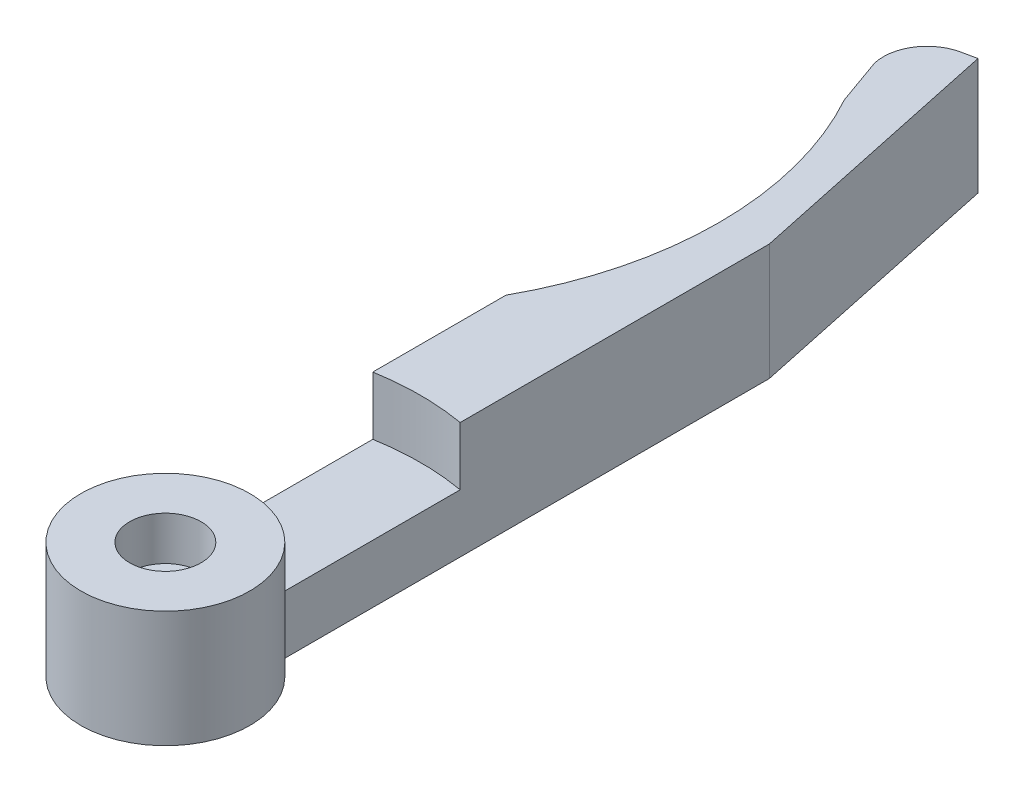
ISO-10303-21;
HEADER;
FILE_DESCRIPTION(('STEP AP214'),'2;1');
FILE_NAME('part.step','',(''),(''),'','','');
FILE_SCHEMA(('AUTOMOTIVE_DESIGN { 1 0 10303 214 1 1 1 1 }'));
ENDSEC;
DATA;
#1=APPLICATION_CONTEXT('core data for automotive mechanical design processes');
#2=APPLICATION_PROTOCOL_DEFINITION('international standard','automotive_design',2000,#1);
#3=PRODUCT_CONTEXT('',#1,'mechanical');
#4=PRODUCT('Part','Part','',(#3));
#5=PRODUCT_RELATED_PRODUCT_CATEGORY('part','',(#4));
#6=PRODUCT_DEFINITION_FORMATION('','',#4);
#7=PRODUCT_DEFINITION_CONTEXT('part definition',#1,'design');
#8=PRODUCT_DEFINITION('design','',#6,#7);
#9=PRODUCT_DEFINITION_SHAPE('','',#8);
#10=(LENGTH_UNIT() NAMED_UNIT(*) SI_UNIT(.MILLI.,.METRE.));
#11=(NAMED_UNIT(*) PLANE_ANGLE_UNIT() SI_UNIT($,.RADIAN.));
#12=(NAMED_UNIT(*) SI_UNIT($,.STERADIAN.) SOLID_ANGLE_UNIT());
#13=UNCERTAINTY_MEASURE_WITH_UNIT(LENGTH_MEASURE(1.E-05),#10,'distance_accuracy_value','');
#14=(GEOMETRIC_REPRESENTATION_CONTEXT(3) GLOBAL_UNCERTAINTY_ASSIGNED_CONTEXT((#13)) GLOBAL_UNIT_ASSIGNED_CONTEXT((#10,
#11,#12)) REPRESENTATION_CONTEXT('',''));
#15=CARTESIAN_POINT('',(0.,0.,0.));
#16=DIRECTION('',(0.,0.,1.));
#17=DIRECTION('',(1.,0.,0.));
#18=AXIS2_PLACEMENT_3D('',#15,#16,#17);
#19=CARTESIAN_POINT('',(0.,8.,0.));
#20=DIRECTION('',(0.,1.,0.));
#21=DIRECTION('',(0.,0.,1.));
#22=AXIS2_PLACEMENT_3D('',#19,#20,#21);
#23=PLANE('',#22);
#24=CARTESIAN_POINT('',(0.,8.,0.));
#25=DIRECTION('',(0.,1.,0.));
#26=DIRECTION('',(0.,0.,1.));
#27=AXIS2_PLACEMENT_3D('',#24,#25,#26);
#28=CIRCLE('',#27,5.8);
#29=CARTESIAN_POINT('',(0.,8.,5.8));
#30=VERTEX_POINT('',#29);
#31=EDGE_CURVE('E163',#30,#30,#28,.T.);
#32=ORIENTED_EDGE('',*,*,#31,.T.);
#33=EDGE_LOOP('',(#32));
#34=FACE_BOUND('',#33,.T.);
#35=CARTESIAN_POINT('',(0.,8.,0.));
#36=DIRECTION('',(0.,1.,0.));
#37=DIRECTION('',(0.,0.,1.));
#38=AXIS2_PLACEMENT_3D('',#35,#36,#37);
#39=CIRCLE('',#38,2.45000000000001);
#40=CARTESIAN_POINT('',(0.,8.,2.45000000000003));
#41=VERTEX_POINT('',#40);
#42=EDGE_CURVE('E193',#41,#41,#39,.T.);
#43=ORIENTED_EDGE('',*,*,#42,.F.);
#44=EDGE_LOOP('',(#43));
#45=FACE_BOUND('',#44,.T.);
#46=ADVANCED_FACE('F41',(#34,#45),#23,.T.);
#47=CARTESIAN_POINT('',(0.,-0.00100000000000013,0.));
#48=DIRECTION('',(0.,1.,0.));
#49=DIRECTION('',(0.,0.,1.));
#50=AXIS2_PLACEMENT_3D('',#47,#48,#49);
#51=CYLINDRICAL_SURFACE('',#50,1.25);
#52=CARTESIAN_POINT('',(0.,5.,0.));
#53=DIRECTION('',(0.,1.,0.));
#54=DIRECTION('',(0.,0.,1.));
#55=AXIS2_PLACEMENT_3D('',#52,#53,#54);
#56=CIRCLE('',#55,1.25);
#57=CARTESIAN_POINT('',(0.,5.,1.25000000000002));
#58=VERTEX_POINT('',#57);
#59=EDGE_CURVE('E196',#58,#58,#56,.T.);
#60=ORIENTED_EDGE('',*,*,#59,.T.);
#61=EDGE_LOOP('',(#60));
#62=FACE_BOUND('',#61,.T.);
#63=CARTESIAN_POINT('',(0.,2.,0.));
#64=DIRECTION('',(0.,-1.,0.));
#65=DIRECTION('',(0.,0.,-1.));
#66=AXIS2_PLACEMENT_3D('',#63,#64,#65);
#67=CIRCLE('',#66,1.25);
#68=CARTESIAN_POINT('',(0.,2.,-1.24999999999998));
#69=VERTEX_POINT('',#68);
#70=EDGE_CURVE('E45',#69,#69,#67,.F.);
#71=ORIENTED_EDGE('',*,*,#70,.F.);
#72=EDGE_LOOP('',(#71));
#73=FACE_BOUND('',#72,.T.);
#74=ADVANCED_FACE('F251',(#62,#73),#51,.F.);
#75=CARTESIAN_POINT('',(0.,8.,0.));
#76=DIRECTION('',(0.,-1.,0.));
#77=DIRECTION('',(0.,0.,-1.));
#78=AXIS2_PLACEMENT_3D('',#75,#76,#77);
#79=CYLINDRICAL_SURFACE('',#78,5.8);
#80=DIRECTION('',(0.,-1.,0.));
#81=VECTOR('',#80,1.);
#82=CARTESIAN_POINT('',(2.99999999999999,8.,-4.96386945839635));
#83=LINE('',#82,#81);
#84=CARTESIAN_POINT('',(2.99999999999999,4.,-4.96386945839635));
#85=VERTEX_POINT('',#84);
#86=CARTESIAN_POINT('',(2.99999999999999,0.,-4.96386945839635));
#87=VERTEX_POINT('',#86);
#88=EDGE_CURVE('E11',#85,#87,#83,.T.);
#89=ORIENTED_EDGE('',*,*,#88,.F.);
#90=CARTESIAN_POINT('',(0.,4.,0.));
#91=DIRECTION('',(0.,-1.,0.));
#92=DIRECTION('',(0.,0.,-1.));
#93=AXIS2_PLACEMENT_3D('',#90,#91,#92);
#94=CIRCLE('',#93,5.80000000000002);
#95=CARTESIAN_POINT('',(-2.99999999999999,4.,-4.96386945839635));
#96=VERTEX_POINT('',#95);
#97=EDGE_CURVE('E214',#96,#85,#94,.T.);
#98=ORIENTED_EDGE('',*,*,#97,.F.);
#99=DIRECTION('',(0.,-1.,0.));
#100=VECTOR('',#99,1.);
#101=CARTESIAN_POINT('',(-2.99999999999999,8.,-4.96386945839635));
#102=LINE('',#101,#100);
#103=CARTESIAN_POINT('',(-2.99999999999999,0.,-4.96386945839635));
#104=VERTEX_POINT('',#103);
#105=EDGE_CURVE('E99',#96,#104,#102,.T.);
#106=ORIENTED_EDGE('',*,*,#105,.T.);
#107=CARTESIAN_POINT('',(0.,0.,0.));
#108=DIRECTION('',(0.,1.,0.));
#109=DIRECTION('',(0.,0.,1.));
#110=AXIS2_PLACEMENT_3D('',#107,#108,#109);
#111=CIRCLE('',#110,5.8);
#112=EDGE_CURVE('E147',#104,#87,#111,.T.);
#113=ORIENTED_EDGE('',*,*,#112,.T.);
#114=EDGE_LOOP('',(#89,#98,#106,#113));
#115=FACE_BOUND('',#114,.T.);
#116=ORIENTED_EDGE('',*,*,#31,.F.);
#117=EDGE_LOOP('',(#116));
#118=FACE_BOUND('',#117,.T.);
#119=ADVANCED_FACE('F43',(#115,#118),#79,.T.);
#120=CARTESIAN_POINT('',(3.,8.,-38.4638694583963));
#121=DIRECTION('',(-1.,0.,0.));
#122=DIRECTION('',(0.,0.,1.));
#123=AXIS2_PLACEMENT_3D('',#120,#121,#122);
#124=PLANE('',#123);
#125=DIRECTION('',(0.,0.,-1.));
#126=VECTOR('',#125,1.);
#127=CARTESIAN_POINT('',(3.,8.,-38.4638694583963));
#128=LINE('',#127,#126);
#129=CARTESIAN_POINT('',(3.,8.,-17.2409396495667));
#130=VERTEX_POINT('',#129);
#131=CARTESIAN_POINT('',(3.,8.,-38.4638694583963));
#132=VERTEX_POINT('',#131);
#133=EDGE_CURVE('E106',#130,#132,#128,.T.);
#134=ORIENTED_EDGE('',*,*,#133,.F.);
#135=DIRECTION('',(0.,1.,0.));
#136=VECTOR('',#135,1.);
#137=CARTESIAN_POINT('',(2.99999999999999,4.,-17.2409396495667));
#138=LINE('',#137,#136);
#139=CARTESIAN_POINT('',(2.99999999999999,4.,-17.2409396495667));
#140=VERTEX_POINT('',#139);
#141=EDGE_CURVE('E57',#140,#130,#138,.T.);
#142=ORIENTED_EDGE('',*,*,#141,.F.);
#143=DIRECTION('',(0.,0.,-1.));
#144=VECTOR('',#143,1.);
#145=CARTESIAN_POINT('',(2.99999999999999,4.,-4.96386945839635));
#146=LINE('',#145,#144);
#147=EDGE_CURVE('E220',#85,#140,#146,.T.);
#148=ORIENTED_EDGE('',*,*,#147,.F.);
#149=ORIENTED_EDGE('',*,*,#88,.T.);
#150=DIRECTION('',(0.,0.,-1.));
#151=VECTOR('',#150,1.);
#152=CARTESIAN_POINT('',(3.,0.,-38.4638694583963));
#153=LINE('',#152,#151);
#154=CARTESIAN_POINT('',(3.,0.,-38.4638694583963));
#155=VERTEX_POINT('',#154);
#156=EDGE_CURVE('E149',#87,#155,#153,.T.);
#157=ORIENTED_EDGE('',*,*,#156,.T.);
#158=DIRECTION('',(0.,-1.,0.));
#159=VECTOR('',#158,1.);
#160=CARTESIAN_POINT('',(3.,8.,-38.4638694583963));
#161=LINE('',#160,#159);
#162=EDGE_CURVE('E50',#132,#155,#161,.T.);
#163=ORIENTED_EDGE('',*,*,#162,.F.);
#164=EDGE_LOOP('',(#134,#142,#148,#149,#157,#163));
#165=FACE_BOUND('',#164,.T.);
#166=ADVANCED_FACE('F232',(#165),#124,.F.);
#167=CARTESIAN_POINT('',(-0.867157449210331,8.,-56.6574148320451));
#168=DIRECTION('',(-0.978147600733806,0.,0.20791169081776));
#169=DIRECTION('',(0.20791169081776,0.,0.978147600733806));
#170=AXIS2_PLACEMENT_3D('',#167,#168,#169);
#171=PLANE('',#170);
#172=DIRECTION('',(-0.20791169081776,0.,-0.978147600733805));
#173=VECTOR('',#172,1.);
#174=CARTESIAN_POINT('',(-0.867157449210331,0.,-56.6574148320451));
#175=LINE('',#174,#173);
#176=CARTESIAN_POINT('',(-0.867157449210331,0.,-56.6574148320451));
#177=VERTEX_POINT('',#176);
#178=EDGE_CURVE('E152',#155,#177,#175,.T.);
#179=ORIENTED_EDGE('',*,*,#178,.T.);
#180=DIRECTION('',(0.,-1.,0.));
#181=VECTOR('',#180,1.);
#182=CARTESIAN_POINT('',(-0.867157449210331,8.,-56.6574148320451));
#183=LINE('',#182,#181);
#184=CARTESIAN_POINT('',(-0.867157449210331,8.,-56.6574148320451));
#185=VERTEX_POINT('',#184);
#186=EDGE_CURVE('E170',#185,#177,#183,.T.);
#187=ORIENTED_EDGE('',*,*,#186,.F.);
#188=DIRECTION('',(-0.20791169081776,0.,-0.978147600733805));
#189=VECTOR('',#188,1.);
#190=CARTESIAN_POINT('',(-0.867157449210331,8.,-56.6574148320451));
#191=LINE('',#190,#189);
#192=EDGE_CURVE('E179',#132,#185,#191,.T.);
#193=ORIENTED_EDGE('',*,*,#192,.F.);
#194=ORIENTED_EDGE('',*,*,#162,.T.);
#195=EDGE_LOOP('',(#179,#187,#193,#194));
#196=FACE_BOUND('',#195,.T.);
#197=ADVANCED_FACE('F177',(#196),#171,.F.);
#198=CARTESIAN_POINT('',(-1.84530504994414,8.,-56.4495031412274));
#199=DIRECTION('',(0.207911690817762,0.,0.978147600733805));
#200=DIRECTION('',(0.978147600733805,0.,-0.207911690817762));
#201=AXIS2_PLACEMENT_3D('',#198,#199,#200);
#202=PLANE('',#201);
#203=DIRECTION('',(-0.978147600733805,0.,0.207911690817762));
#204=VECTOR('',#203,1.);
#205=CARTESIAN_POINT('',(-1.84530504994414,0.,-56.4495031412274));
#206=LINE('',#205,#204);
#207=CARTESIAN_POINT('',(-1.84530504994414,0.,-56.4495031412274));
#208=VERTEX_POINT('',#207);
#209=EDGE_CURVE('E154',#177,#208,#206,.T.);
#210=ORIENTED_EDGE('',*,*,#209,.T.);
#211=DIRECTION('',(0.,-1.,0.));
#212=VECTOR('',#211,1.);
#213=CARTESIAN_POINT('',(-1.84530504994414,8.,-56.4495031412274));
#214=LINE('',#213,#212);
#215=CARTESIAN_POINT('',(-1.84530504994414,8.,-56.4495031412274));
#216=VERTEX_POINT('',#215);
#217=EDGE_CURVE('E136',#216,#208,#214,.T.);
#218=ORIENTED_EDGE('',*,*,#217,.F.);
#219=DIRECTION('',(-0.978147600733805,0.,0.207911690817762));
#220=VECTOR('',#219,1.);
#221=CARTESIAN_POINT('',(-1.84530504994414,8.,-56.4495031412274));
#222=LINE('',#221,#220);
#223=EDGE_CURVE('E124',#185,#216,#222,.T.);
#224=ORIENTED_EDGE('',*,*,#223,.F.);
#225=ORIENTED_EDGE('',*,*,#186,.T.);
#226=EDGE_LOOP('',(#210,#218,#224,#225));
#227=FACE_BOUND('',#226,.T.);
#228=ADVANCED_FACE('F187',(#227),#202,.F.);
#229=CARTESIAN_POINT('',(-1.22156997749086,8.,-53.515060339026));
#230=DIRECTION('',(0.,-1.,0.));
#231=DIRECTION('',(0.,0.,-1.));
#232=AXIS2_PLACEMENT_3D('',#229,#230,#231);
#233=CYLINDRICAL_SURFACE('',#232,3.);
#234=CARTESIAN_POINT('',(-1.22156997749086,0.,-53.515060339026));
#235=DIRECTION('',(0.,1.,0.));
#236=DIRECTION('',(0.,0.,-1.));
#237=AXIS2_PLACEMENT_3D('',#234,#235,#236);
#238=CIRCLE('',#237,3.);
#239=CARTESIAN_POINT('',(-4.14041417555798,0.,-52.8219885192194));
#240=VERTEX_POINT('',#239);
#241=EDGE_CURVE('E133',#208,#240,#238,.T.);
#242=ORIENTED_EDGE('',*,*,#241,.T.);
#243=DIRECTION('',(0.,-1.,0.));
#244=VECTOR('',#243,1.);
#245=CARTESIAN_POINT('',(-4.14041417555798,8.,-52.8219885192194));
#246=LINE('',#245,#244);
#247=CARTESIAN_POINT('',(-4.14041417555798,8.,-52.8219885192194));
#248=VERTEX_POINT('',#247);
#249=EDGE_CURVE('E130',#248,#240,#246,.T.);
#250=ORIENTED_EDGE('',*,*,#249,.F.);
#251=CARTESIAN_POINT('',(-1.22156997749086,8.,-53.515060339026));
#252=DIRECTION('',(0.,1.,0.));
#253=DIRECTION('',(0.,0.,-1.));
#254=AXIS2_PLACEMENT_3D('',#251,#252,#253);
#255=CIRCLE('',#254,3.);
#256=EDGE_CURVE('E117',#216,#248,#255,.T.);
#257=ORIENTED_EDGE('',*,*,#256,.F.);
#258=ORIENTED_EDGE('',*,*,#217,.T.);
#259=EDGE_LOOP('',(#242,#250,#257,#258));
#260=FACE_BOUND('',#259,.T.);
#261=ADVANCED_FACE('F131',(#260),#233,.T.);
#262=CARTESIAN_POINT('',(-4.14041417555798,8.,-52.8219885192194));
#263=DIRECTION('',(0.942070141352118,0.,-0.33541593398764));
#264=DIRECTION('',(-0.33541593398764,0.,-0.942070141352118));
#265=AXIS2_PLACEMENT_3D('',#262,#263,#264);
#266=PLANE('',#265);
#267=DIRECTION('',(0.33541593398764,0.,0.942070141352118));
#268=VECTOR('',#267,1.);
#269=CARTESIAN_POINT('',(-4.14041417555798,0.,-52.8219885192194));
#270=LINE('',#269,#268);
#271=CARTESIAN_POINT('',(-3.,0.,-49.6189500386222));
#272=VERTEX_POINT('',#271);
#273=EDGE_CURVE('E157',#240,#272,#270,.T.);
#274=ORIENTED_EDGE('',*,*,#273,.T.);
#275=DIRECTION('',(0.,-1.,0.));
#276=VECTOR('',#275,1.);
#277=CARTESIAN_POINT('',(-3.,8.,-49.6189500386222));
#278=LINE('',#277,#276);
#279=CARTESIAN_POINT('',(-3.,8.,-49.6189500386222));
#280=VERTEX_POINT('',#279);
#281=EDGE_CURVE('E137',#280,#272,#278,.T.);
#282=ORIENTED_EDGE('',*,*,#281,.F.);
#283=DIRECTION('',(0.33541593398764,0.,0.942070141352118));
#284=VECTOR('',#283,1.);
#285=CARTESIAN_POINT('',(-4.14041417555798,8.,-52.8219885192194));
#286=LINE('',#285,#284);
#287=EDGE_CURVE('E121',#248,#280,#286,.T.);
#288=ORIENTED_EDGE('',*,*,#287,.F.);
#289=ORIENTED_EDGE('',*,*,#249,.T.);
#290=EDGE_LOOP('',(#274,#282,#288,#289));
#291=FACE_BOUND('',#290,.T.);
#292=ADVANCED_FACE('F139',(#291),#266,.F.);
#293=CARTESIAN_POINT('',(-24.,8.,-38.));
#294=DIRECTION('',(0.,-1.,0.));
#295=DIRECTION('',(0.,0.,-1.));
#296=AXIS2_PLACEMENT_3D('',#293,#294,#295);
#297=CYLINDRICAL_SURFACE('',#296,24.);
#298=CARTESIAN_POINT('',(-24.,0.,-38.));
#299=DIRECTION('',(0.,-1.,0.));
#300=DIRECTION('',(0.,0.,-1.));
#301=AXIS2_PLACEMENT_3D('',#298,#299,#300);
#302=CIRCLE('',#301,24.);
#303=CARTESIAN_POINT('',(-2.99999999999999,0.,-26.3810499613777));
#304=VERTEX_POINT('',#303);
#305=EDGE_CURVE('E159',#272,#304,#302,.T.);
#306=ORIENTED_EDGE('',*,*,#305,.T.);
#307=DIRECTION('',(0.,-1.,0.));
#308=VECTOR('',#307,1.);
#309=CARTESIAN_POINT('',(-2.99999999999999,8.,-26.3810499613777));
#310=LINE('',#309,#308);
#311=CARTESIAN_POINT('',(-2.99999999999999,8.,-26.3810499613777));
#312=VERTEX_POINT('',#311);
#313=EDGE_CURVE('E165',#312,#304,#310,.T.);
#314=ORIENTED_EDGE('',*,*,#313,.F.);
#315=CARTESIAN_POINT('',(-24.,8.,-38.));
#316=DIRECTION('',(0.,-1.,0.));
#317=DIRECTION('',(0.,0.,-1.));
#318=AXIS2_PLACEMENT_3D('',#315,#316,#317);
#319=CIRCLE('',#318,24.);
#320=EDGE_CURVE('E66',#280,#312,#319,.T.);
#321=ORIENTED_EDGE('',*,*,#320,.F.);
#322=ORIENTED_EDGE('',*,*,#281,.T.);
#323=EDGE_LOOP('',(#306,#314,#321,#322));
#324=FACE_BOUND('',#323,.T.);
#325=ADVANCED_FACE('F240',(#324),#297,.F.);
#326=CARTESIAN_POINT('',(-2.99999999999999,8.,-26.3810499613777));
#327=DIRECTION('',(1.,0.,0.));
#328=DIRECTION('',(0.,0.,-1.));
#329=AXIS2_PLACEMENT_3D('',#326,#327,#328);
#330=PLANE('',#329);
#331=DIRECTION('',(0.,0.,1.));
#332=VECTOR('',#331,1.);
#333=CARTESIAN_POINT('',(-2.99999999999999,4.,-4.96386945839635));
#334=LINE('',#333,#332);
#335=CARTESIAN_POINT('',(-2.99999999999999,4.,-17.2409396495666));
#336=VERTEX_POINT('',#335);
#337=EDGE_CURVE('E209',#336,#96,#334,.T.);
#338=ORIENTED_EDGE('',*,*,#337,.F.);
#339=DIRECTION('',(0.,1.,0.));
#340=VECTOR('',#339,1.);
#341=CARTESIAN_POINT('',(-2.99999999999999,4.,-17.2409396495666));
#342=LINE('',#341,#340);
#343=CARTESIAN_POINT('',(-2.99999999999999,8.,-17.2409396495666));
#344=VERTEX_POINT('',#343);
#345=EDGE_CURVE('E205',#336,#344,#342,.T.);
#346=ORIENTED_EDGE('',*,*,#345,.T.);
#347=DIRECTION('',(0.,0.,1.));
#348=VECTOR('',#347,1.);
#349=CARTESIAN_POINT('',(-2.99999999999999,8.,-26.3810499613777));
#350=LINE('',#349,#348);
#351=EDGE_CURVE('E142',#312,#344,#350,.T.);
#352=ORIENTED_EDGE('',*,*,#351,.F.);
#353=ORIENTED_EDGE('',*,*,#313,.T.);
#354=DIRECTION('',(0.,0.,1.));
#355=VECTOR('',#354,1.);
#356=CARTESIAN_POINT('',(-2.99999999999999,0.,-26.3810499613777));
#357=LINE('',#356,#355);
#358=EDGE_CURVE('E161',#304,#104,#357,.T.);
#359=ORIENTED_EDGE('',*,*,#358,.T.);
#360=ORIENTED_EDGE('',*,*,#105,.F.);
#361=EDGE_LOOP('',(#338,#346,#352,#353,#359,#360));
#362=FACE_BOUND('',#361,.T.);
#363=ADVANCED_FACE('F237',(#362),#330,.F.);
#364=CARTESIAN_POINT('',(0.,8.,0.));
#365=DIRECTION('',(0.,1.,0.));
#366=DIRECTION('',(0.,0.,-1.));
#367=AXIS2_PLACEMENT_3D('',#364,#365,#366);
#368=CIRCLE('',#367,17.5);
#369=EDGE_CURVE('E212',#130,#344,#368,.T.);
#370=ORIENTED_EDGE('',*,*,#369,.F.);
#371=ORIENTED_EDGE('',*,*,#133,.T.);
#372=ORIENTED_EDGE('',*,*,#192,.T.);
#373=ORIENTED_EDGE('',*,*,#223,.T.);
#374=ORIENTED_EDGE('',*,*,#256,.T.);
#375=ORIENTED_EDGE('',*,*,#287,.T.);
#376=ORIENTED_EDGE('',*,*,#320,.T.);
#377=ORIENTED_EDGE('',*,*,#351,.T.);
#378=EDGE_LOOP('',(#370,#371,#372,#373,#374,#375,#376,#377));
#379=FACE_BOUND('',#378,.T.);
#380=ADVANCED_FACE('F119',(#379),#23,.T.);
#381=CARTESIAN_POINT('',(0.,0.,0.));
#382=DIRECTION('',(0.,1.,0.));
#383=DIRECTION('',(0.,0.,1.));
#384=AXIS2_PLACEMENT_3D('',#381,#382,#383);
#385=PLANE('',#384);
#386=CARTESIAN_POINT('',(0.,0.,0.));
#387=DIRECTION('',(0.,-1.,0.));
#388=DIRECTION('',(0.,0.,-1.));
#389=AXIS2_PLACEMENT_3D('',#386,#387,#388);
#390=CIRCLE('',#389,3.);
#391=CARTESIAN_POINT('',(0.,0.,-2.99999999999998));
#392=VERTEX_POINT('',#391);
#393=EDGE_CURVE('E201',#392,#392,#390,.T.);
#394=ORIENTED_EDGE('',*,*,#393,.F.);
#395=EDGE_LOOP('',(#394));
#396=FACE_BOUND('',#395,.T.);
#397=ORIENTED_EDGE('',*,*,#112,.F.);
#398=ORIENTED_EDGE('',*,*,#358,.F.);
#399=ORIENTED_EDGE('',*,*,#305,.F.);
#400=ORIENTED_EDGE('',*,*,#273,.F.);
#401=ORIENTED_EDGE('',*,*,#241,.F.);
#402=ORIENTED_EDGE('',*,*,#209,.F.);
#403=ORIENTED_EDGE('',*,*,#178,.F.);
#404=ORIENTED_EDGE('',*,*,#156,.F.);
#405=EDGE_LOOP('',(#397,#398,#399,#400,#401,#402,#403,#404));
#406=FACE_BOUND('',#405,.T.);
#407=ADVANCED_FACE('F185',(#396,#406),#385,.F.);
#408=CARTESIAN_POINT('',(0.,5.,0.));
#409=DIRECTION('',(0.,1.,0.));
#410=DIRECTION('',(0.,0.,1.));
#411=AXIS2_PLACEMENT_3D('',#408,#409,#410);
#412=CYLINDRICAL_SURFACE('',#411,2.45000000000001);
#413=CARTESIAN_POINT('',(0.,5.,0.));
#414=DIRECTION('',(0.,1.,0.));
#415=DIRECTION('',(0.,0.,1.));
#416=AXIS2_PLACEMENT_3D('',#413,#414,#415);
#417=CIRCLE('',#416,2.45000000000001);
#418=CARTESIAN_POINT('',(0.,5.,2.45000000000003));
#419=VERTEX_POINT('',#418);
#420=EDGE_CURVE('E150',#419,#419,#417,.T.);
#421=ORIENTED_EDGE('',*,*,#420,.F.);
#422=EDGE_LOOP('',(#421));
#423=FACE_BOUND('',#422,.T.);
#424=ORIENTED_EDGE('',*,*,#42,.T.);
#425=EDGE_LOOP('',(#424));
#426=FACE_BOUND('',#425,.T.);
#427=ADVANCED_FACE('F269',(#423,#426),#412,.F.);
#428=CARTESIAN_POINT('',(0.,5.,0.));
#429=DIRECTION('',(0.,1.,0.));
#430=DIRECTION('',(0.,0.,1.));
#431=AXIS2_PLACEMENT_3D('',#428,#429,#430);
#432=PLANE('',#431);
#433=ORIENTED_EDGE('',*,*,#59,.F.);
#434=EDGE_LOOP('',(#433));
#435=FACE_BOUND('',#434,.T.);
#436=ORIENTED_EDGE('',*,*,#420,.T.);
#437=EDGE_LOOP('',(#436));
#438=FACE_BOUND('',#437,.T.);
#439=ADVANCED_FACE('F274',(#435,#438),#432,.T.);
#440=CARTESIAN_POINT('',(0.,2.,0.));
#441=DIRECTION('',(0.,-1.,0.));
#442=DIRECTION('',(0.,0.,-1.));
#443=AXIS2_PLACEMENT_3D('',#440,#441,#442);
#444=PLANE('',#443);
#445=CARTESIAN_POINT('',(0.,2.,0.));
#446=DIRECTION('',(0.,-1.,0.));
#447=DIRECTION('',(0.,0.,-1.));
#448=AXIS2_PLACEMENT_3D('',#445,#446,#447);
#449=CIRCLE('',#448,3.);
#450=CARTESIAN_POINT('',(0.,2.,-2.99999999999998));
#451=VERTEX_POINT('',#450);
#452=EDGE_CURVE('E204',#451,#451,#449,.T.);
#453=ORIENTED_EDGE('',*,*,#452,.T.);
#454=EDGE_LOOP('',(#453));
#455=FACE_BOUND('',#454,.T.);
#456=ORIENTED_EDGE('',*,*,#70,.T.);
#457=EDGE_LOOP('',(#456));
#458=FACE_BOUND('',#457,.T.);
#459=ADVANCED_FACE('F280',(#455,#458),#444,.T.);
#460=CARTESIAN_POINT('',(0.,2.,0.));
#461=DIRECTION('',(0.,-1.,0.));
#462=DIRECTION('',(0.,0.,-1.));
#463=AXIS2_PLACEMENT_3D('',#460,#461,#462);
#464=CYLINDRICAL_SURFACE('',#463,3.);
#465=ORIENTED_EDGE('',*,*,#452,.F.);
#466=EDGE_LOOP('',(#465));
#467=FACE_BOUND('',#466,.T.);
#468=ORIENTED_EDGE('',*,*,#393,.T.);
#469=EDGE_LOOP('',(#468));
#470=FACE_BOUND('',#469,.T.);
#471=ADVANCED_FACE('F278',(#467,#470),#464,.F.);
#472=CARTESIAN_POINT('',(0.,4.,0.));
#473=DIRECTION('',(0.,1.,0.));
#474=DIRECTION('',(0.,0.,1.));
#475=AXIS2_PLACEMENT_3D('',#472,#473,#474);
#476=CYLINDRICAL_SURFACE('',#475,17.5);
#477=ORIENTED_EDGE('',*,*,#369,.T.);
#478=ORIENTED_EDGE('',*,*,#345,.F.);
#479=CARTESIAN_POINT('',(0.,4.,0.));
#480=DIRECTION('',(0.,1.,0.));
#481=DIRECTION('',(0.,0.,-1.));
#482=AXIS2_PLACEMENT_3D('',#479,#480,#481);
#483=CIRCLE('',#482,17.5);
#484=EDGE_CURVE('E217',#140,#336,#483,.T.);
#485=ORIENTED_EDGE('',*,*,#484,.F.);
#486=ORIENTED_EDGE('',*,*,#141,.T.);
#487=EDGE_LOOP('',(#477,#478,#485,#486));
#488=FACE_BOUND('',#487,.T.);
#489=ADVANCED_FACE('F279',(#488),#476,.F.);
#490=CARTESIAN_POINT('',(0.,4.,0.));
#491=DIRECTION('',(0.,-1.,0.));
#492=DIRECTION('',(0.,0.,-1.));
#493=AXIS2_PLACEMENT_3D('',#490,#491,#492);
#494=PLANE('',#493);
#495=ORIENTED_EDGE('',*,*,#97,.T.);
#496=ORIENTED_EDGE('',*,*,#147,.T.);
#497=ORIENTED_EDGE('',*,*,#484,.T.);
#498=ORIENTED_EDGE('',*,*,#337,.T.);
#499=EDGE_LOOP('',(#495,#496,#497,#498));
#500=FACE_BOUND('',#499,.T.);
#501=ADVANCED_FACE('F227',(#500),#494,.F.);
#502=CLOSED_SHELL('',(#46,#74,#119,#166,#197,#228,#261,#292,#325,#363,#380,#407,#427,#439,#459,
#471,#489,#501));
#503=MANIFOLD_SOLID_BREP('B2',#502);
#504=ADVANCED_BREP_SHAPE_REPRESENTATION('',(#18,#503),#14);
#505=SHAPE_DEFINITION_REPRESENTATION(#9,#504);
ENDSEC;
END-ISO-10303-21;
